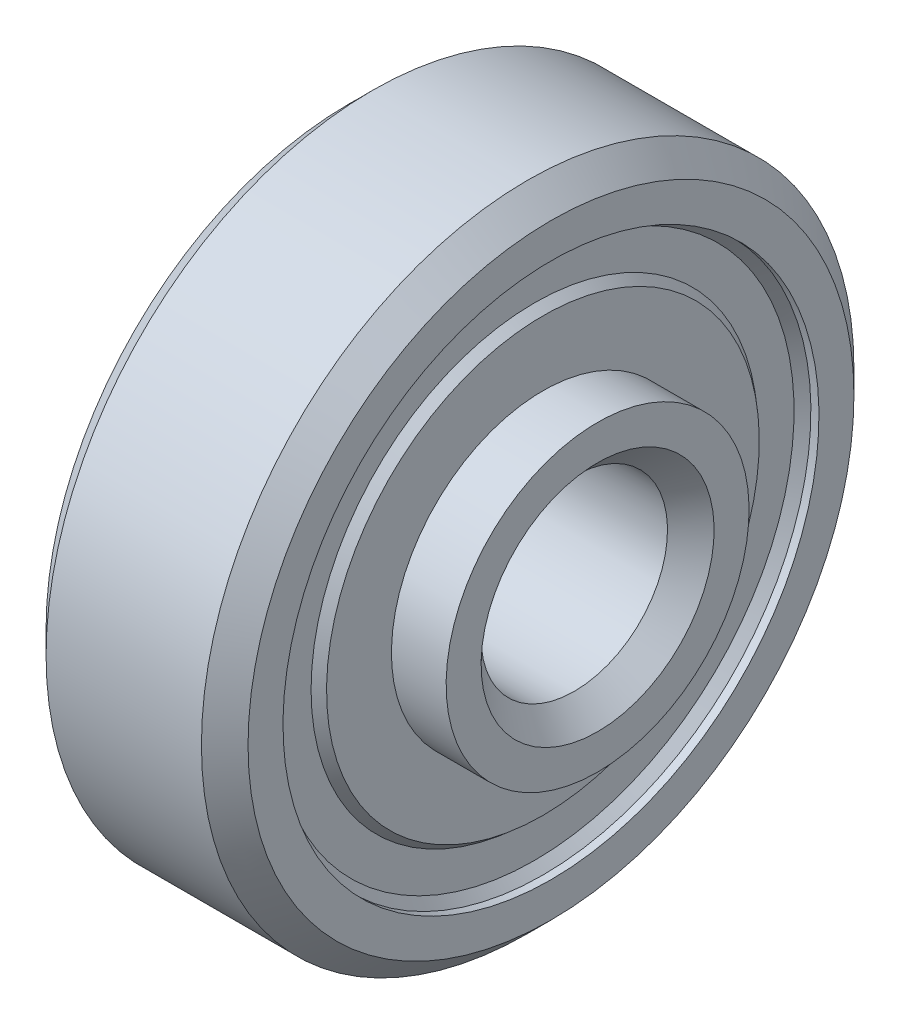
ISO-10303-21;
HEADER;
FILE_DESCRIPTION(('STEP AP214'),'2;1');
FILE_NAME('part.step','',(''),(''),'','','');
FILE_SCHEMA(('AUTOMOTIVE_DESIGN { 1 0 10303 214 1 1 1 1 }'));
ENDSEC;
DATA;
#1=APPLICATION_CONTEXT('core data for automotive mechanical design processes');
#2=APPLICATION_PROTOCOL_DEFINITION('international standard','automotive_design',2000,#1);
#3=PRODUCT_CONTEXT('',#1,'mechanical');
#4=PRODUCT('Part','Part','',(#3));
#5=PRODUCT_RELATED_PRODUCT_CATEGORY('part','',(#4));
#6=PRODUCT_DEFINITION_FORMATION('','',#4);
#7=PRODUCT_DEFINITION_CONTEXT('part definition',#1,'design');
#8=PRODUCT_DEFINITION('design','',#6,#7);
#9=PRODUCT_DEFINITION_SHAPE('','',#8);
#10=(LENGTH_UNIT() NAMED_UNIT(*) SI_UNIT(.MILLI.,.METRE.));
#11=(NAMED_UNIT(*) PLANE_ANGLE_UNIT() SI_UNIT($,.RADIAN.));
#12=(NAMED_UNIT(*) SI_UNIT($,.STERADIAN.) SOLID_ANGLE_UNIT());
#13=UNCERTAINTY_MEASURE_WITH_UNIT(LENGTH_MEASURE(1.E-05),#10,'distance_accuracy_value','');
#14=(GEOMETRIC_REPRESENTATION_CONTEXT(3) GLOBAL_UNCERTAINTY_ASSIGNED_CONTEXT((#13)) GLOBAL_UNIT_ASSIGNED_CONTEXT((#10,
#11,#12)) REPRESENTATION_CONTEXT('',''));
#15=CARTESIAN_POINT('',(0.,0.,0.));
#16=DIRECTION('',(0.,0.,1.));
#17=DIRECTION('',(1.,0.,0.));
#18=AXIS2_PLACEMENT_3D('',#15,#16,#17);
#19=CARTESIAN_POINT('',(11.6666666666667,0.,0.));
#20=DIRECTION('',(-1.,0.,0.));
#21=DIRECTION('',(0.,-1.,0.));
#22=AXIS2_PLACEMENT_3D('',#19,#20,#21);
#23=TOROIDAL_SURFACE('',#22,13.3249973942044,1.875);
#24=CARTESIAN_POINT('',(12.0967939863605,0.,0.));
#25=DIRECTION('',(-1.,0.,0.));
#26=DIRECTION('',(0.,-1.,0.));
#27=AXIS2_PLACEMENT_3D('',#24,#25,#26);
#28=CIRCLE('',#27,11.4999999999999);
#29=CARTESIAN_POINT('',(12.0967939863606,-11.4999999999998,0.));
#30=VERTEX_POINT('',#29);
#31=EDGE_CURVE('E99',#30,#30,#28,.T.);
#32=ORIENTED_EDGE('',*,*,#31,.T.);
#33=EDGE_LOOP('',(#32));
#34=FACE_BOUND('',#33,.T.);
#35=CARTESIAN_POINT('',(11.236539346973,0.,0.));
#36=DIRECTION('',(-1.,0.,0.));
#37=DIRECTION('',(0.,-1.,0.));
#38=AXIS2_PLACEMENT_3D('',#35,#36,#37);
#39=CIRCLE('',#38,11.4999999999999);
#40=CARTESIAN_POINT('',(11.2365393469731,-11.4999999999999,0.));
#41=VERTEX_POINT('',#40);
#42=EDGE_CURVE('E11',#41,#41,#39,.T.);
#43=ORIENTED_EDGE('',*,*,#42,.F.);
#44=EDGE_LOOP('',(#43));
#45=FACE_BOUND('',#44,.T.);
#46=ADVANCED_FACE('F50',(#34,#45),#23,.F.);
#47=CARTESIAN_POINT('',(0.,0.,0.));
#48=DIRECTION('',(-1.,0.,0.));
#49=DIRECTION('',(0.,-1.,0.));
#50=AXIS2_PLACEMENT_3D('',#47,#48,#49);
#51=CYLINDRICAL_SURFACE('',#50,11.4999999999999);
#52=ORIENTED_EDGE('',*,*,#42,.T.);
#53=EDGE_LOOP('',(#52));
#54=FACE_BOUND('',#53,.T.);
#55=CARTESIAN_POINT('',(7.76346065302716,0.,0.));
#56=DIRECTION('',(-1.,0.,0.));
#57=DIRECTION('',(0.,-1.,0.));
#58=AXIS2_PLACEMENT_3D('',#55,#56,#57);
#59=CIRCLE('',#58,11.5);
#60=CARTESIAN_POINT('',(7.76346065302723,-11.4999999999999,0.));
#61=VERTEX_POINT('',#60);
#62=EDGE_CURVE('E56',#61,#61,#59,.T.);
#63=ORIENTED_EDGE('',*,*,#62,.F.);
#64=EDGE_LOOP('',(#63));
#65=FACE_BOUND('',#64,.T.);
#66=ADVANCED_FACE('F117',(#54,#65),#51,.T.);
#67=CARTESIAN_POINT('',(7.33333333333341,0.,0.));
#68=DIRECTION('',(-1.,0.,0.));
#69=DIRECTION('',(0.,-1.,0.));
#70=AXIS2_PLACEMENT_3D('',#67,#68,#69);
#71=TOROIDAL_SURFACE('',#70,13.3249973942044,1.875);
#72=ORIENTED_EDGE('',*,*,#62,.T.);
#73=EDGE_LOOP('',(#72));
#74=FACE_BOUND('',#73,.T.);
#75=CARTESIAN_POINT('',(6.90320601363964,0.,0.));
#76=DIRECTION('',(-1.,0.,0.));
#77=DIRECTION('',(0.,-1.,0.));
#78=AXIS2_PLACEMENT_3D('',#75,#76,#77);
#79=CIRCLE('',#78,11.5);
#80=CARTESIAN_POINT('',(6.90320601363971,-11.4999999999999,0.));
#81=VERTEX_POINT('',#80);
#82=EDGE_CURVE('E60',#81,#81,#79,.T.);
#83=ORIENTED_EDGE('',*,*,#82,.F.);
#84=EDGE_LOOP('',(#83));
#85=FACE_BOUND('',#84,.T.);
#86=ADVANCED_FACE('F121',(#74,#85),#71,.F.);
#87=CARTESIAN_POINT('',(0.,0.,0.));
#88=DIRECTION('',(-1.,0.,0.));
#89=DIRECTION('',(0.,-1.,0.));
#90=AXIS2_PLACEMENT_3D('',#87,#88,#89);
#91=CYLINDRICAL_SURFACE('',#90,11.5);
#92=ORIENTED_EDGE('',*,*,#82,.T.);
#93=EDGE_LOOP('',(#92));
#94=FACE_BOUND('',#93,.T.);
#95=CARTESIAN_POINT('',(5.16666666666674,0.,0.));
#96=DIRECTION('',(-1.,0.,0.));
#97=DIRECTION('',(0.,-1.,0.));
#98=AXIS2_PLACEMENT_3D('',#95,#96,#97);
#99=CIRCLE('',#98,11.5);
#100=CARTESIAN_POINT('',(5.16666666666681,-11.4999999999999,0.));
#101=VERTEX_POINT('',#100);
#102=EDGE_CURVE('E64',#101,#101,#99,.T.);
#103=ORIENTED_EDGE('',*,*,#102,.F.);
#104=EDGE_LOOP('',(#103));
#105=FACE_BOUND('',#104,.T.);
#106=ADVANCED_FACE('F125',(#94,#105),#91,.T.);
#107=CARTESIAN_POINT('',(4.62500000000006,0.,0.));
#108=DIRECTION('',(1.,0.,0.));
#109=DIRECTION('',(0.,1.,0.));
#110=AXIS2_PLACEMENT_3D('',#107,#108,#109);
#111=CONICAL_SURFACE('',#110,9.74999999999997,1.27062515596478);
#112=ORIENTED_EDGE('',*,*,#102,.T.);
#113=EDGE_LOOP('',(#112));
#114=FACE_BOUND('',#113,.T.);
#115=CARTESIAN_POINT('',(4.62500000000006,0.,0.));
#116=DIRECTION('',(-1.,0.,0.));
#117=DIRECTION('',(0.,-1.,0.));
#118=AXIS2_PLACEMENT_3D('',#115,#116,#117);
#119=CIRCLE('',#118,9.74999999999997);
#120=CARTESIAN_POINT('',(4.62500000000012,-9.74999999999995,0.));
#121=VERTEX_POINT('',#120);
#122=EDGE_CURVE('E69',#121,#121,#119,.T.);
#123=ORIENTED_EDGE('',*,*,#122,.F.);
#124=EDGE_LOOP('',(#123));
#125=FACE_BOUND('',#124,.T.);
#126=ADVANCED_FACE('F131',(#114,#125),#111,.T.);
#127=CARTESIAN_POINT('',(0.,0.,0.));
#128=DIRECTION('',(-1.,0.,0.));
#129=DIRECTION('',(0.,-1.,0.));
#130=AXIS2_PLACEMENT_3D('',#127,#128,#129);
#131=CYLINDRICAL_SURFACE('',#130,9.74999999999999);
#132=ORIENTED_EDGE('',*,*,#122,.T.);
#133=EDGE_LOOP('',(#132));
#134=FACE_BOUND('',#133,.T.);
#135=CARTESIAN_POINT('',(0.,0.,0.));
#136=DIRECTION('',(-1.,0.,0.));
#137=DIRECTION('',(0.,-1.,0.));
#138=AXIS2_PLACEMENT_3D('',#135,#136,#137);
#139=CIRCLE('',#138,9.75);
#140=CARTESIAN_POINT('',(1.15715623682421E-13,-9.75,0.));
#141=VERTEX_POINT('',#140);
#142=EDGE_CURVE('E72',#141,#141,#139,.T.);
#143=ORIENTED_EDGE('',*,*,#142,.F.);
#144=EDGE_LOOP('',(#143));
#145=FACE_BOUND('',#144,.T.);
#146=ADVANCED_FACE('F135',(#134,#145),#131,.T.);
#147=CARTESIAN_POINT('',(1.52655665885959E-13,-5.47038840179403,0.));
#148=DIRECTION('',(-1.,0.,0.));
#149=DIRECTION('',(0.,-1.,0.));
#150=AXIS2_PLACEMENT_3D('',#147,#148,#149);
#151=PLANE('',#150);
#152=ORIENTED_EDGE('',*,*,#142,.T.);
#153=EDGE_LOOP('',(#152));
#154=FACE_BOUND('',#153,.T.);
#155=CARTESIAN_POINT('',(0.,0.,0.));
#156=DIRECTION('',(-1.,0.,0.));
#157=DIRECTION('',(0.,-1.,0.));
#158=AXIS2_PLACEMENT_3D('',#155,#156,#157);
#159=CIRCLE('',#158,7.50000000010686);
#160=CARTESIAN_POINT('',(1.01822283886659E-13,-7.50000000010686,0.));
#161=VERTEX_POINT('',#160);
#162=EDGE_CURVE('E76',#161,#161,#159,.T.);
#163=ORIENTED_EDGE('',*,*,#162,.F.);
#164=EDGE_LOOP('',(#163));
#165=FACE_BOUND('',#164,.T.);
#166=ADVANCED_FACE('F139',(#154,#165),#151,.T.);
#167=CARTESIAN_POINT('',(0.,0.,0.));
#168=DIRECTION('',(-1.,0.,0.));
#169=DIRECTION('',(0.,-1.,0.));
#170=AXIS2_PLACEMENT_3D('',#167,#168,#169);
#171=CONICAL_SURFACE('',#170,7.50000000010686,0.785398163397455);
#172=CARTESIAN_POINT('',(1.5000000001103,0.,0.));
#173=DIRECTION('',(-1.,0.,0.));
#174=DIRECTION('',(0.,-1.,0.));
#175=AXIS2_PLACEMENT_3D('',#172,#173,#174);
#176=CIRCLE('',#175,5.99999999999658);
#177=CARTESIAN_POINT('',(1.50000000011034,-5.99999999999658,0.));
#178=VERTEX_POINT('',#177);
#179=EDGE_CURVE('E80',#178,#178,#176,.T.);
#180=ORIENTED_EDGE('',*,*,#179,.F.);
#181=EDGE_LOOP('',(#180));
#182=FACE_BOUND('',#181,.T.);
#183=ORIENTED_EDGE('',*,*,#162,.T.);
#184=EDGE_LOOP('',(#183));
#185=FACE_BOUND('',#184,.T.);
#186=ADVANCED_FACE('F143',(#182,#185),#171,.F.);
#187=CARTESIAN_POINT('',(0.,0.,0.));
#188=DIRECTION('',(-1.,0.,0.));
#189=DIRECTION('',(0.,-1.,0.));
#190=AXIS2_PLACEMENT_3D('',#187,#188,#189);
#191=CYLINDRICAL_SURFACE('',#190,5.99999999999653);
#192=CARTESIAN_POINT('',(17.5000000001104,1.06685493772574E-13,0.));
#193=DIRECTION('',(-1.,0.,0.));
#194=DIRECTION('',(0.,-1.,0.));
#195=AXIS2_PLACEMENT_3D('',#192,#193,#194);
#196=CIRCLE('',#195,5.99999999999648);
#197=CARTESIAN_POINT('',(17.5000000001104,-5.99999999999638,0.));
#198=VERTEX_POINT('',#197);
#199=EDGE_CURVE('E84',#198,#198,#196,.T.);
#200=ORIENTED_EDGE('',*,*,#199,.F.);
#201=EDGE_LOOP('',(#200));
#202=FACE_BOUND('',#201,.T.);
#203=ORIENTED_EDGE('',*,*,#179,.T.);
#204=EDGE_LOOP('',(#203));
#205=FACE_BOUND('',#204,.T.);
#206=ADVANCED_FACE('F147',(#202,#205),#191,.F.);
#207=CARTESIAN_POINT('',(17.5000000001104,1.06685493772574E-13,0.));
#208=DIRECTION('',(1.,0.,0.));
#209=DIRECTION('',(0.,1.,0.));
#210=AXIS2_PLACEMENT_3D('',#207,#208,#209);
#211=CONICAL_SURFACE('',#210,5.99999999999648,0.785398163397442);
#212=CARTESIAN_POINT('',(19.0000000001104,1.17961196366423E-13,0.));
#213=DIRECTION('',(-1.,0.,0.));
#214=DIRECTION('',(0.,-1.,0.));
#215=AXIS2_PLACEMENT_3D('',#212,#213,#214);
#216=CIRCLE('',#215,7.49999999999647);
#217=CARTESIAN_POINT('',(19.0000000001104,-7.49999999999636,0.));
#218=VERTEX_POINT('',#217);
#219=EDGE_CURVE('E87',#218,#218,#216,.T.);
#220=ORIENTED_EDGE('',*,*,#219,.F.);
#221=EDGE_LOOP('',(#220));
#222=FACE_BOUND('',#221,.T.);
#223=ORIENTED_EDGE('',*,*,#199,.T.);
#224=EDGE_LOOP('',(#223));
#225=FACE_BOUND('',#224,.T.);
#226=ADVANCED_FACE('F151',(#222,#225),#211,.F.);
#227=CARTESIAN_POINT('',(19.0000000001104,-5.47038840179402,0.));
#228=DIRECTION('',(-1.,0.,0.));
#229=DIRECTION('',(0.,-1.,0.));
#230=AXIS2_PLACEMENT_3D('',#227,#228,#229);
#231=PLANE('',#230);
#232=CARTESIAN_POINT('',(19.0000000001104,1.17961196366423E-13,0.));
#233=DIRECTION('',(-1.,0.,0.));
#234=DIRECTION('',(0.,-1.,0.));
#235=AXIS2_PLACEMENT_3D('',#232,#233,#234);
#236=CIRCLE('',#235,9.74999999999988);
#237=CARTESIAN_POINT('',(19.0000000001104,-9.74999999999976,0.));
#238=VERTEX_POINT('',#237);
#239=EDGE_CURVE('E90',#238,#238,#236,.T.);
#240=ORIENTED_EDGE('',*,*,#239,.F.);
#241=EDGE_LOOP('',(#240));
#242=FACE_BOUND('',#241,.T.);
#243=ORIENTED_EDGE('',*,*,#219,.T.);
#244=EDGE_LOOP('',(#243));
#245=FACE_BOUND('',#244,.T.);
#246=ADVANCED_FACE('F155',(#242,#245),#231,.F.);
#247=CARTESIAN_POINT('',(0.,0.,0.));
#248=DIRECTION('',(-1.,0.,0.));
#249=DIRECTION('',(0.,-1.,0.));
#250=AXIS2_PLACEMENT_3D('',#247,#248,#249);
#251=CYLINDRICAL_SURFACE('',#250,9.7499999999999);
#252=ORIENTED_EDGE('',*,*,#239,.T.);
#253=EDGE_LOOP('',(#252));
#254=FACE_BOUND('',#253,.T.);
#255=CARTESIAN_POINT('',(14.3750000000001,0.,0.));
#256=DIRECTION('',(-1.,0.,0.));
#257=DIRECTION('',(0.,-1.,0.));
#258=AXIS2_PLACEMENT_3D('',#255,#256,#257);
#259=CIRCLE('',#258,9.74999999999991);
#260=CARTESIAN_POINT('',(14.3750000000001,-9.74999999999982,0.));
#261=VERTEX_POINT('',#260);
#262=EDGE_CURVE('E93',#261,#261,#259,.T.);
#263=ORIENTED_EDGE('',*,*,#262,.F.);
#264=EDGE_LOOP('',(#263));
#265=FACE_BOUND('',#264,.T.);
#266=ADVANCED_FACE('F113',(#254,#265),#251,.T.);
#267=CARTESIAN_POINT('',(13.8333333333334,0.,0.));
#268=DIRECTION('',(-1.,0.,0.));
#269=DIRECTION('',(0.,-1.,0.));
#270=AXIS2_PLACEMENT_3D('',#267,#268,#269);
#271=CONICAL_SURFACE('',#270,11.4999999999999,1.27062515596479);
#272=ORIENTED_EDGE('',*,*,#262,.T.);
#273=EDGE_LOOP('',(#272));
#274=FACE_BOUND('',#273,.T.);
#275=CARTESIAN_POINT('',(13.8333333333334,0.,0.));
#276=DIRECTION('',(-1.,0.,0.));
#277=DIRECTION('',(0.,-1.,0.));
#278=AXIS2_PLACEMENT_3D('',#275,#276,#277);
#279=CIRCLE('',#278,11.4999999999999);
#280=CARTESIAN_POINT('',(13.8333333333335,-11.4999999999998,0.));
#281=VERTEX_POINT('',#280);
#282=EDGE_CURVE('E96',#281,#281,#279,.T.);
#283=ORIENTED_EDGE('',*,*,#282,.F.);
#284=EDGE_LOOP('',(#283));
#285=FACE_BOUND('',#284,.T.);
#286=ADVANCED_FACE('F107',(#274,#285),#271,.T.);
#287=CARTESIAN_POINT('',(0.,0.,0.));
#288=DIRECTION('',(-1.,0.,0.));
#289=DIRECTION('',(0.,-1.,0.));
#290=AXIS2_PLACEMENT_3D('',#287,#288,#289);
#291=CYLINDRICAL_SURFACE('',#290,11.4999999999999);
#292=ORIENTED_EDGE('',*,*,#282,.T.);
#293=EDGE_LOOP('',(#292));
#294=FACE_BOUND('',#293,.T.);
#295=ORIENTED_EDGE('',*,*,#31,.F.);
#296=EDGE_LOOP('',(#295));
#297=FACE_BOUND('',#296,.T.);
#298=ADVANCED_FACE('F105',(#294,#297),#291,.T.);
#299=CLOSED_SHELL('',(#46,#66,#86,#106,#126,#146,#166,#186,#206,#226,#246,#266,#286,#298));
#300=MANIFOLD_SOLID_BREP('B2',#299);
#301=CARTESIAN_POINT('',(9.50000000000001,0.,0.));
#302=DIRECTION('',(-1.,0.,0.));
#303=DIRECTION('',(0.,1.,0.));
#304=AXIS2_PLACEMENT_3D('',#301,#302,#303);
#305=SPHERICAL_SURFACE('',#304,15.375);
#306=CARTESIAN_POINT('',(5.16666666666676,0.,0.));
#307=DIRECTION('',(-1.,0.,0.));
#308=DIRECTION('',(0.,-1.,0.));
#309=AXIS2_PLACEMENT_3D('',#306,#307,#308);
#310=CIRCLE('',#309,14.7517065867723);
#311=CARTESIAN_POINT('',(5.16666666666667,14.7517065867723,0.));
#312=VERTEX_POINT('',#311);
#313=EDGE_CURVE('E337',#312,#312,#310,.T.);
#314=CARTESIAN_POINT('',(13.8333333333334,0.,0.));
#315=DIRECTION('',(-1.,0.,0.));
#316=DIRECTION('',(0.,-1.,0.));
#317=AXIS2_PLACEMENT_3D('',#314,#315,#316);
#318=CIRCLE('',#317,14.7517065867723);
#319=CARTESIAN_POINT('',(13.8333333333333,14.7517065867723,0.));
#320=VERTEX_POINT('',#319);
#321=EDGE_CURVE('E49',#320,#320,#318,.T.);
#322=CARTESIAN_POINT('',(5.16666666666667,14.7517065867723,0.));
#323=CARTESIAN_POINT('',(5.2544744083613,14.7775003246166,0.));
#324=CARTESIAN_POINT('',(5.34251249946757,14.8025098875159,0.));
#325=CARTESIAN_POINT('',(5.51902119911412,14.8509530849714,0.));
#326=CARTESIAN_POINT('',(5.60749180765442,14.8743867195275,0.));
#327=CARTESIAN_POINT('',(5.78483736077979,14.9196704818431,0.));
#328=CARTESIAN_POINT('',(5.87371230536488,14.9415206096025,0.));
#329=CARTESIAN_POINT('',(6.05183818330579,14.9836304194508,0.));
#330=CARTESIAN_POINT('',(6.14108911666162,15.0038901015398,0.));
#331=CARTESIAN_POINT('',(6.31993851488075,15.0428125522382,0.));
#332=CARTESIAN_POINT('',(6.40953697974405,15.0614753208477,0.));
#333=CARTESIAN_POINT('',(6.58905287024463,15.0971979956518,0.));
#334=CARTESIAN_POINT('',(6.6789702958819,15.1142579018465,0.));
#335=CARTESIAN_POINT('',(6.85909543620113,15.1467694113984,0.));
#336=CARTESIAN_POINT('',(6.94930315088309,15.1622210147556,0.));
#337=CARTESIAN_POINT('',(7.12998010480774,15.191510991742,0.));
#338=CARTESIAN_POINT('',(7.22044934405043,15.2053493653711,0.));
#339=CARTESIAN_POINT('',(7.40162049927156,15.2314084702337,0.));
#340=CARTESIAN_POINT('',(7.49232241525,15.2436292014671,0.));
#341=CARTESIAN_POINT('',(7.67393000191058,15.2664491247364,0.));
#342=CARTESIAN_POINT('',(7.76483567259271,15.2770483167723,0.));
#343=CARTESIAN_POINT('',(7.94682178166121,15.29662178189,0.));
#344=CARTESIAN_POINT('',(8.03790222004757,15.3055960549718,0.));
#345=CARTESIAN_POINT('',(8.22020882179611,15.3219168205645,0.));
#346=CARTESIAN_POINT('',(8.31143498515827,15.3292633130755,0.));
#347=CARTESIAN_POINT('',(8.49400394766305,15.3423261749576,0.));
#348=CARTESIAN_POINT('',(8.58534674680566,15.3480425443289,0.));
#349=CARTESIAN_POINT('',(8.76811985448437,15.3578433371586,0.));
#350=CARTESIAN_POINT('',(8.85955016302047,15.3619277606172,0.));
#351=CARTESIAN_POINT('',(9.04246913519519,15.3684633592256,0.));
#352=CARTESIAN_POINT('',(9.1339577988338,15.3709145343754,0.));
#353=CARTESIAN_POINT('',(9.31696430831495,15.3741828547626,0.));
#354=CARTESIAN_POINT('',(9.40848215415747,15.375,0.));
#355=CARTESIAN_POINT('',(9.59151784584252,15.375,0.));
#356=CARTESIAN_POINT('',(9.68303569168505,15.3741828547626,0.));
#357=CARTESIAN_POINT('',(9.8660422011662,15.3709145343754,0.));
#358=CARTESIAN_POINT('',(9.95753086480481,15.3684633592256,0.));
#359=CARTESIAN_POINT('',(10.1404498369795,15.3619277606172,0.));
#360=CARTESIAN_POINT('',(10.2318801455156,15.3578433371586,0.));
#361=CARTESIAN_POINT('',(10.4146532531943,15.3480425443289,0.));
#362=CARTESIAN_POINT('',(10.505996052337,15.3423261749576,0.));
#363=CARTESIAN_POINT('',(10.6885650148417,15.3292633130755,0.));
#364=CARTESIAN_POINT('',(10.7797911782039,15.3219168205645,0.));
#365=CARTESIAN_POINT('',(10.9620977799524,15.3055960549718,0.));
#366=CARTESIAN_POINT('',(11.0531782183388,15.29662178189,0.));
#367=CARTESIAN_POINT('',(11.2351643274073,15.2770483167723,0.));
#368=CARTESIAN_POINT('',(11.3260699980894,15.2664491247364,0.));
#369=CARTESIAN_POINT('',(11.50767758475,15.2436292014671,0.));
#370=CARTESIAN_POINT('',(11.5983795007284,15.2314084702337,0.));
#371=CARTESIAN_POINT('',(11.7795506559496,15.2053493653711,0.));
#372=CARTESIAN_POINT('',(11.8700198951923,15.191510991742,0.));
#373=CARTESIAN_POINT('',(12.0506968491169,15.1622210147556,0.));
#374=CARTESIAN_POINT('',(12.1409045637989,15.1467694113984,0.));
#375=CARTESIAN_POINT('',(12.3210297041181,15.1142579018465,0.));
#376=CARTESIAN_POINT('',(12.4109471297554,15.0971979956518,0.));
#377=CARTESIAN_POINT('',(12.5904630202559,15.0614753208477,0.));
#378=CARTESIAN_POINT('',(12.6800614851193,15.0428125522382,0.));
#379=CARTESIAN_POINT('',(12.8589108833384,15.0038901015398,0.));
#380=CARTESIAN_POINT('',(12.9481618166942,14.9836304194508,0.));
#381=CARTESIAN_POINT('',(13.1262876946351,14.9415206096025,0.));
#382=CARTESIAN_POINT('',(13.2151626392202,14.9196704818431,0.));
#383=CARTESIAN_POINT('',(13.3925081923456,14.8743867195275,0.));
#384=CARTESIAN_POINT('',(13.4809788008859,14.8509530849714,0.));
#385=CARTESIAN_POINT('',(13.6574875005324,14.8025098875159,0.));
#386=CARTESIAN_POINT('',(13.7455255916387,14.7775003246166,0.));
#387=CARTESIAN_POINT('',(13.8333333333333,14.7517065867723,0.));
#388=B_SPLINE_CURVE_WITH_KNOTS('',3,(#322,#323,#324,#325,#326,#327,#328,#329,#330,#331,#332,
#333,#334,#335,#336,#337,#338,#339,#340,#341,#342,#343,#344,#345,#346,#347,#348,#349,#350,#351,
#352,#353,#354,#355,#356,#357,#358,#359,#360,#361,#362,#363,#364,#365,#366,#367,#368,#369,#370,
#371,#372,#373,#374,#375,#376,#377,#378,#379,#380,#381,#382,#383,#384,#385,#386,#387),
.UNSPECIFIED.,.F.,.F.,(4,2,2,2,2,2,2,2,2,2,2,2,2,2,2,2,2,2,2,2,2,2,2,2,2,2,2,2,2,2,2,2,4),(0.,
0.274549889824796,0.54909977964959,0.823649669474385,1.09819955929918,1.37274944912398,
1.64729933894877,1.92184922877357,2.19639911859836,2.47094900842316,2.74549889824795,
3.02004878807275,3.29459867789754,3.56914856772234,3.84369845754713,4.11824834737193,
4.39279823719672,4.66734812702152,4.94189801684631,5.2164479066711,5.4909977964959,
5.76554768632069,6.04009757614549,6.31464746597029,6.58919735579508,6.86374724561987,
7.13829713544467,7.41284702526947,7.68739691509426,7.96194680491905,8.23649669474385,
8.51104658456864,8.78559647439344),.UNSPECIFIED.);
#389=EDGE_CURVE('BSEAM292',#312,#320,#388,.T.);
#390=ORIENTED_EDGE('',*,*,#313,.T.);
#391=ORIENTED_EDGE('',*,*,#321,.F.);
#392=ORIENTED_EDGE('',*,*,#389,.T.);
#393=ORIENTED_EDGE('',*,*,#389,.F.);
#394=EDGE_LOOP('',(#390,#392,#391,#393));
#395=FACE_BOUND('',#394,.T.);
#396=ADVANCED_FACE('F292',(#395),#305,.F.);
#397=CARTESIAN_POINT('',(13.8333333333335,-5.47038840179402,0.));
#398=DIRECTION('',(1.,0.,0.));
#399=DIRECTION('',(0.,1.,0.));
#400=AXIS2_PLACEMENT_3D('',#397,#398,#399);
#401=PLANE('',#400);
#402=ORIENTED_EDGE('',*,*,#321,.T.);
#403=EDGE_LOOP('',(#402));
#404=FACE_BOUND('',#403,.T.);
#405=CARTESIAN_POINT('',(13.8333333333334,0.,0.));
#406=DIRECTION('',(-1.,0.,0.));
#407=DIRECTION('',(0.,-1.,0.));
#408=AXIS2_PLACEMENT_3D('',#405,#406,#407);
#409=CIRCLE('',#408,18.8966666666666);
#410=CARTESIAN_POINT('',(13.8333333333336,-18.8966666666665,0.));
#411=VERTEX_POINT('',#410);
#412=EDGE_CURVE('E298',#411,#411,#409,.T.);
#413=ORIENTED_EDGE('',*,*,#412,.F.);
#414=EDGE_LOOP('',(#413));
#415=FACE_BOUND('',#414,.T.);
#416=ADVANCED_FACE('F374',(#404,#415),#401,.T.);
#417=CARTESIAN_POINT('',(13.8333333333334,0.,0.));
#418=DIRECTION('',(-1.,0.,0.));
#419=DIRECTION('',(0.,-1.,0.));
#420=AXIS2_PLACEMENT_3D('',#417,#418,#419);
#421=CONICAL_SURFACE('',#420,18.8966666666666,0.78539816339745);
#422=CARTESIAN_POINT('',(15.4800000000001,0.,0.));
#423=DIRECTION('',(-1.,0.,0.));
#424=DIRECTION('',(0.,-1.,0.));
#425=AXIS2_PLACEMENT_3D('',#422,#423,#424);
#426=CIRCLE('',#425,17.2499999999999);
#427=CARTESIAN_POINT('',(15.4800000000002,-17.2499999999998,0.));
#428=VERTEX_POINT('',#427);
#429=EDGE_CURVE('E303',#428,#428,#426,.T.);
#430=ORIENTED_EDGE('',*,*,#429,.F.);
#431=EDGE_LOOP('',(#430));
#432=FACE_BOUND('',#431,.T.);
#433=ORIENTED_EDGE('',*,*,#412,.T.);
#434=EDGE_LOOP('',(#433));
#435=FACE_BOUND('',#434,.T.);
#436=ADVANCED_FACE('F378',(#432,#435),#421,.F.);
#437=CARTESIAN_POINT('',(0.,0.,0.));
#438=DIRECTION('',(-1.,0.,0.));
#439=DIRECTION('',(0.,-1.,0.));
#440=AXIS2_PLACEMENT_3D('',#437,#438,#439);
#441=CYLINDRICAL_SURFACE('',#440,17.2499999999999);
#442=CARTESIAN_POINT('',(16.0000000000001,0.,0.));
#443=DIRECTION('',(-1.,0.,0.));
#444=DIRECTION('',(0.,-1.,0.));
#445=AXIS2_PLACEMENT_3D('',#442,#443,#444);
#446=CIRCLE('',#445,17.2499999999999);
#447=CARTESIAN_POINT('',(16.0000000000002,-17.2499999999998,0.));
#448=VERTEX_POINT('',#447);
#449=EDGE_CURVE('E310',#448,#448,#446,.T.);
#450=ORIENTED_EDGE('',*,*,#449,.F.);
#451=EDGE_LOOP('',(#450));
#452=FACE_BOUND('',#451,.T.);
#453=ORIENTED_EDGE('',*,*,#429,.T.);
#454=EDGE_LOOP('',(#453));
#455=FACE_BOUND('',#454,.T.);
#456=ADVANCED_FACE('F382',(#452,#455),#441,.F.);
#457=CARTESIAN_POINT('',(16.0000000000002,-5.47038840179403,0.));
#458=DIRECTION('',(-1.,0.,0.));
#459=DIRECTION('',(0.,-1.,0.));
#460=AXIS2_PLACEMENT_3D('',#457,#458,#459);
#461=PLANE('',#460);
#462=CARTESIAN_POINT('',(16.0000000000001,0.,0.));
#463=DIRECTION('',(-1.,0.,0.));
#464=DIRECTION('',(0.,-1.,0.));
#465=AXIS2_PLACEMENT_3D('',#462,#463,#464);
#466=CIRCLE('',#465,19.4999999999999);
#467=CARTESIAN_POINT('',(16.0000000000002,-19.4999999999998,0.));
#468=VERTEX_POINT('',#467);
#469=EDGE_CURVE('E315',#468,#468,#466,.T.);
#470=ORIENTED_EDGE('',*,*,#469,.F.);
#471=EDGE_LOOP('',(#470));
#472=FACE_BOUND('',#471,.T.);
#473=ORIENTED_EDGE('',*,*,#449,.T.);
#474=EDGE_LOOP('',(#473));
#475=FACE_BOUND('',#474,.T.);
#476=ADVANCED_FACE('F389',(#472,#475),#461,.F.);
#477=CARTESIAN_POINT('',(14.5000000000001,0.,0.));
#478=DIRECTION('',(-1.,0.,0.));
#479=DIRECTION('',(0.,-1.,0.));
#480=AXIS2_PLACEMENT_3D('',#477,#478,#479);
#481=CONICAL_SURFACE('',#480,20.9999999999999,0.785398163397459);
#482=ORIENTED_EDGE('',*,*,#469,.T.);
#483=EDGE_LOOP('',(#482));
#484=FACE_BOUND('',#483,.T.);
#485=CARTESIAN_POINT('',(14.5000000000001,0.,0.));
#486=DIRECTION('',(-1.,0.,0.));
#487=DIRECTION('',(0.,-1.,0.));
#488=AXIS2_PLACEMENT_3D('',#485,#486,#487);
#489=CIRCLE('',#488,20.9999999999999);
#490=CARTESIAN_POINT('',(14.5000000000003,-20.9999999999998,0.));
#491=VERTEX_POINT('',#490);
#492=EDGE_CURVE('E319',#491,#491,#489,.T.);
#493=ORIENTED_EDGE('',*,*,#492,.F.);
#494=EDGE_LOOP('',(#493));
#495=FACE_BOUND('',#494,.T.);
#496=ADVANCED_FACE('F393',(#484,#495),#481,.T.);
#497=CARTESIAN_POINT('',(0.,0.,0.));
#498=DIRECTION('',(-1.,0.,0.));
#499=DIRECTION('',(0.,-1.,0.));
#500=AXIS2_PLACEMENT_3D('',#497,#498,#499);
#501=CYLINDRICAL_SURFACE('',#500,20.9999999999999);
#502=ORIENTED_EDGE('',*,*,#492,.T.);
#503=EDGE_LOOP('',(#502));
#504=FACE_BOUND('',#503,.T.);
#505=CARTESIAN_POINT('',(4.50000000000012,0.,0.));
#506=DIRECTION('',(-1.,0.,0.));
#507=DIRECTION('',(0.,-1.,0.));
#508=AXIS2_PLACEMENT_3D('',#505,#506,#507);
#509=CIRCLE('',#508,21.);
#510=CARTESIAN_POINT('',(4.50000000000025,-21.,0.));
#511=VERTEX_POINT('',#510);
#512=EDGE_CURVE('E322',#511,#511,#509,.T.);
#513=ORIENTED_EDGE('',*,*,#512,.F.);
#514=EDGE_LOOP('',(#513));
#515=FACE_BOUND('',#514,.T.);
#516=ADVANCED_FACE('F370',(#504,#515),#501,.T.);
#517=CARTESIAN_POINT('',(3.00000000000011,0.,0.));
#518=DIRECTION('',(1.,0.,0.));
#519=DIRECTION('',(0.,1.,0.));
#520=AXIS2_PLACEMENT_3D('',#517,#518,#519);
#521=CONICAL_SURFACE('',#520,19.5,0.785398163397442);
#522=ORIENTED_EDGE('',*,*,#512,.T.);
#523=EDGE_LOOP('',(#522));
#524=FACE_BOUND('',#523,.T.);
#525=CARTESIAN_POINT('',(3.00000000000011,0.,0.));
#526=DIRECTION('',(-1.,0.,0.));
#527=DIRECTION('',(0.,-1.,0.));
#528=AXIS2_PLACEMENT_3D('',#525,#526,#527);
#529=CIRCLE('',#528,19.5);
#530=CARTESIAN_POINT('',(3.00000000000023,-19.5,0.));
#531=VERTEX_POINT('',#530);
#532=EDGE_CURVE('E325',#531,#531,#529,.T.);
#533=ORIENTED_EDGE('',*,*,#532,.F.);
#534=EDGE_LOOP('',(#533));
#535=FACE_BOUND('',#534,.T.);
#536=ADVANCED_FACE('F364',(#524,#535),#521,.T.);
#537=CARTESIAN_POINT('',(3.00000000000021,-5.47038840179402,0.));
#538=DIRECTION('',(-1.,0.,0.));
#539=DIRECTION('',(0.,-1.,0.));
#540=AXIS2_PLACEMENT_3D('',#537,#538,#539);
#541=PLANE('',#540);
#542=ORIENTED_EDGE('',*,*,#532,.T.);
#543=EDGE_LOOP('',(#542));
#544=FACE_BOUND('',#543,.T.);
#545=CARTESIAN_POINT('',(3.00000000000011,0.,0.));
#546=DIRECTION('',(-1.,0.,0.));
#547=DIRECTION('',(0.,-1.,0.));
#548=AXIS2_PLACEMENT_3D('',#545,#546,#547);
#549=CIRCLE('',#548,17.25);
#550=CARTESIAN_POINT('',(3.00000000000022,-17.25,0.));
#551=VERTEX_POINT('',#550);
#552=EDGE_CURVE('E328',#551,#551,#549,.T.);
#553=ORIENTED_EDGE('',*,*,#552,.F.);
#554=EDGE_LOOP('',(#553));
#555=FACE_BOUND('',#554,.T.);
#556=ADVANCED_FACE('F359',(#544,#555),#541,.T.);
#557=CARTESIAN_POINT('',(0.,0.,0.));
#558=DIRECTION('',(-1.,0.,0.));
#559=DIRECTION('',(0.,-1.,0.));
#560=AXIS2_PLACEMENT_3D('',#557,#558,#559);
#561=CYLINDRICAL_SURFACE('',#560,17.25);
#562=CARTESIAN_POINT('',(3.52000000000011,0.,0.));
#563=DIRECTION('',(-1.,0.,0.));
#564=DIRECTION('',(0.,-1.,0.));
#565=AXIS2_PLACEMENT_3D('',#562,#563,#564);
#566=CIRCLE('',#565,17.25);
#567=CARTESIAN_POINT('',(3.52000000000021,-17.25,0.));
#568=VERTEX_POINT('',#567);
#569=EDGE_CURVE('E331',#568,#568,#566,.T.);
#570=ORIENTED_EDGE('',*,*,#569,.F.);
#571=EDGE_LOOP('',(#570));
#572=FACE_BOUND('',#571,.T.);
#573=ORIENTED_EDGE('',*,*,#552,.T.);
#574=EDGE_LOOP('',(#573));
#575=FACE_BOUND('',#574,.T.);
#576=ADVANCED_FACE('F353',(#572,#575),#561,.F.);
#577=CARTESIAN_POINT('',(3.52000000000011,0.,0.));
#578=DIRECTION('',(1.,0.,0.));
#579=DIRECTION('',(0.,1.,0.));
#580=AXIS2_PLACEMENT_3D('',#577,#578,#579);
#581=CONICAL_SURFACE('',#580,17.25,0.785398163397437);
#582=CARTESIAN_POINT('',(5.16666666666679,0.,0.));
#583=DIRECTION('',(-1.,0.,0.));
#584=DIRECTION('',(0.,-1.,0.));
#585=AXIS2_PLACEMENT_3D('',#582,#583,#584);
#586=CIRCLE('',#585,18.8966666666666);
#587=CARTESIAN_POINT('',(5.16666666666691,-18.8966666666666,0.));
#588=VERTEX_POINT('',#587);
#589=EDGE_CURVE('E334',#588,#588,#586,.T.);
#590=ORIENTED_EDGE('',*,*,#589,.F.);
#591=EDGE_LOOP('',(#590));
#592=FACE_BOUND('',#591,.T.);
#593=ORIENTED_EDGE('',*,*,#569,.T.);
#594=EDGE_LOOP('',(#593));
#595=FACE_BOUND('',#594,.T.);
#596=ADVANCED_FACE('F347',(#592,#595),#581,.F.);
#597=CARTESIAN_POINT('',(5.16666666666687,-5.47038840179405,0.));
#598=DIRECTION('',(1.,0.,0.));
#599=DIRECTION('',(0.,1.,0.));
#600=AXIS2_PLACEMENT_3D('',#597,#598,#599);
#601=PLANE('',#600);
#602=ORIENTED_EDGE('',*,*,#313,.F.);
#603=EDGE_LOOP('',(#602));
#604=FACE_BOUND('',#603,.T.);
#605=ORIENTED_EDGE('',*,*,#589,.T.);
#606=EDGE_LOOP('',(#605));
#607=FACE_BOUND('',#606,.T.);
#608=ADVANCED_FACE('F344',(#604,#607),#601,.F.);
#609=CLOSED_SHELL('',(#396,#416,#436,#456,#476,#496,#516,#536,#556,#576,#596,#608));
#610=MANIFOLD_SOLID_BREP('B6',#609);
#611=CARTESIAN_POINT('',(13.8333333333335,-5.47038840179402,0.));
#612=DIRECTION('',(-1.,0.,0.));
#613=DIRECTION('',(0.,-1.,0.));
#614=AXIS2_PLACEMENT_3D('',#611,#612,#613);
#615=PLANE('',#614);
#616=CARTESIAN_POINT('',(13.8333333333334,0.,0.));
#617=DIRECTION('',(-1.,0.,0.));
#618=DIRECTION('',(0.,-1.,0.));
#619=AXIS2_PLACEMENT_3D('',#616,#617,#618);
#620=CIRCLE('',#619,17.1660393197555);
#621=CARTESIAN_POINT('',(13.8333333333336,-17.1660393197554,0.));
#622=VERTEX_POINT('',#621);
#623=EDGE_CURVE('E545',#622,#622,#620,.T.);
#624=ORIENTED_EDGE('',*,*,#623,.T.);
#625=EDGE_LOOP('',(#624));
#626=FACE_BOUND('',#625,.T.);
#627=CARTESIAN_POINT('',(13.8333333333334,0.,0.));
#628=DIRECTION('',(-1.,0.,0.));
#629=DIRECTION('',(0.,-1.,0.));
#630=AXIS2_PLACEMENT_3D('',#627,#628,#629);
#631=CIRCLE('',#630,13.8657993844721);
#632=CARTESIAN_POINT('',(13.8333333333335,-13.865799384472,0.));
#633=VERTEX_POINT('',#632);
#634=EDGE_CURVE('E291',#633,#633,#631,.T.);
#635=ORIENTED_EDGE('',*,*,#634,.F.);
#636=EDGE_LOOP('',(#635));
#637=FACE_BOUND('',#636,.T.);
#638=ADVANCED_FACE('F511',(#626,#637),#615,.T.);
#639=CARTESIAN_POINT('',(13.8333333333334,0.,0.));
#640=DIRECTION('',(-1.,0.,0.));
#641=DIRECTION('',(0.,-1.,0.));
#642=AXIS2_PLACEMENT_3D('',#639,#640,#641);
#643=CONICAL_SURFACE('',#642,13.8657993844721,0.698131700797729);
#644=CARTESIAN_POINT('',(14.3750000000001,0.,0.));
#645=DIRECTION('',(-1.,0.,0.));
#646=DIRECTION('',(0.,-1.,0.));
#647=AXIS2_PLACEMENT_3D('',#644,#645,#646);
#648=CIRCLE('',#647,13.411287084251);
#649=CARTESIAN_POINT('',(14.3750000000002,-13.4112870842509,0.));
#650=VERTEX_POINT('',#649);
#651=EDGE_CURVE('E517',#650,#650,#648,.T.);
#652=ORIENTED_EDGE('',*,*,#651,.F.);
#653=EDGE_LOOP('',(#652));
#654=FACE_BOUND('',#653,.T.);
#655=ORIENTED_EDGE('',*,*,#634,.T.);
#656=EDGE_LOOP('',(#655));
#657=FACE_BOUND('',#656,.T.);
#658=ADVANCED_FACE('F563',(#654,#657),#643,.F.);
#659=CARTESIAN_POINT('',(14.3750000000002,-5.47038840179403,0.));
#660=DIRECTION('',(-1.,0.,0.));
#661=DIRECTION('',(0.,-1.,0.));
#662=AXIS2_PLACEMENT_3D('',#659,#660,#661);
#663=PLANE('',#662);
#664=ORIENTED_EDGE('',*,*,#651,.T.);
#665=EDGE_LOOP('',(#664));
#666=FACE_BOUND('',#665,.T.);
#667=CARTESIAN_POINT('',(14.3750000000001,0.,0.));
#668=DIRECTION('',(-1.,0.,0.));
#669=DIRECTION('',(0.,-1.,0.));
#670=AXIS2_PLACEMENT_3D('',#667,#668,#669);
#671=CIRCLE('',#670,9.74999999999991);
#672=CARTESIAN_POINT('',(14.3750000000001,-9.74999999999982,0.));
#673=VERTEX_POINT('',#672);
#674=EDGE_CURVE('E521',#673,#673,#671,.T.);
#675=ORIENTED_EDGE('',*,*,#674,.F.);
#676=EDGE_LOOP('',(#675));
#677=FACE_BOUND('',#676,.T.);
#678=ADVANCED_FACE('F567',(#666,#677),#663,.T.);
#679=CARTESIAN_POINT('',(0.,0.,0.));
#680=DIRECTION('',(-1.,0.,0.));
#681=DIRECTION('',(0.,-1.,0.));
#682=AXIS2_PLACEMENT_3D('',#679,#680,#681);
#683=CYLINDRICAL_SURFACE('',#682,9.74999999999991);
#684=CARTESIAN_POINT('',(15.4800000000001,0.,0.));
#685=DIRECTION('',(-1.,0.,0.));
#686=DIRECTION('',(0.,-1.,0.));
#687=AXIS2_PLACEMENT_3D('',#684,#685,#686);
#688=CIRCLE('',#687,9.7499999999999);
#689=CARTESIAN_POINT('',(15.4800000000001,-9.74999999999981,0.));
#690=VERTEX_POINT('',#689);
#691=EDGE_CURVE('E525',#690,#690,#688,.T.);
#692=ORIENTED_EDGE('',*,*,#691,.F.);
#693=EDGE_LOOP('',(#692));
#694=FACE_BOUND('',#693,.T.);
#695=ORIENTED_EDGE('',*,*,#674,.T.);
#696=EDGE_LOOP('',(#695));
#697=FACE_BOUND('',#696,.T.);
#698=ADVANCED_FACE('F572',(#694,#697),#683,.F.);
#699=CARTESIAN_POINT('',(15.4800000000002,-5.47038840179402,0.));
#700=DIRECTION('',(-1.,0.,0.));
#701=DIRECTION('',(0.,-1.,0.));
#702=AXIS2_PLACEMENT_3D('',#699,#700,#701);
#703=PLANE('',#702);
#704=CARTESIAN_POINT('',(15.4800000000001,0.,0.));
#705=DIRECTION('',(-1.,0.,0.));
#706=DIRECTION('',(0.,-1.,0.));
#707=AXIS2_PLACEMENT_3D('',#704,#705,#706);
#708=CIRCLE('',#707,13.9265570465123);
#709=CARTESIAN_POINT('',(15.4800000000002,-13.9265570465122,0.));
#710=VERTEX_POINT('',#709);
#711=EDGE_CURVE('E530',#710,#710,#708,.T.);
#712=ORIENTED_EDGE('',*,*,#711,.F.);
#713=EDGE_LOOP('',(#712));
#714=FACE_BOUND('',#713,.T.);
#715=ORIENTED_EDGE('',*,*,#691,.T.);
#716=EDGE_LOOP('',(#715));
#717=FACE_BOUND('',#716,.T.);
#718=ADVANCED_FACE('F577',(#714,#717),#703,.F.);
#719=CARTESIAN_POINT('',(14.9383333333334,0.,0.));
#720=DIRECTION('',(-1.,0.,0.));
#721=DIRECTION('',(0.,-1.,0.));
#722=AXIS2_PLACEMENT_3D('',#719,#720,#721);
#723=CONICAL_SURFACE('',#722,14.3810693467333,0.698131700797738);
#724=ORIENTED_EDGE('',*,*,#711,.T.);
#725=EDGE_LOOP('',(#724));
#726=FACE_BOUND('',#725,.T.);
#727=CARTESIAN_POINT('',(14.9383333333334,0.,0.));
#728=DIRECTION('',(-1.,0.,0.));
#729=DIRECTION('',(0.,-1.,0.));
#730=AXIS2_PLACEMENT_3D('',#727,#728,#729);
#731=CIRCLE('',#730,14.3810693467333);
#732=CARTESIAN_POINT('',(14.9383333333335,-14.3810693467332,0.));
#733=VERTEX_POINT('',#732);
#734=EDGE_CURVE('E533',#733,#733,#731,.T.);
#735=ORIENTED_EDGE('',*,*,#734,.F.);
#736=EDGE_LOOP('',(#735));
#737=FACE_BOUND('',#736,.T.);
#738=ADVANCED_FACE('F581',(#726,#737),#723,.T.);
#739=CARTESIAN_POINT('',(14.9383333333335,-5.47038840179403,0.));
#740=DIRECTION('',(-1.,0.,0.));
#741=DIRECTION('',(0.,-1.,0.));
#742=AXIS2_PLACEMENT_3D('',#739,#740,#741);
#743=PLANE('',#742);
#744=CARTESIAN_POINT('',(14.9383333333334,0.,0.));
#745=DIRECTION('',(-1.,0.,0.));
#746=DIRECTION('',(0.,-1.,0.));
#747=AXIS2_PLACEMENT_3D('',#744,#745,#746);
#748=CIRCLE('',#747,16.7083333333332);
#749=CARTESIAN_POINT('',(14.9383333333335,-16.7083333333331,0.));
#750=VERTEX_POINT('',#749);
#751=EDGE_CURVE('E536',#750,#750,#748,.T.);
#752=ORIENTED_EDGE('',*,*,#751,.F.);
#753=EDGE_LOOP('',(#752));
#754=FACE_BOUND('',#753,.T.);
#755=ORIENTED_EDGE('',*,*,#734,.T.);
#756=EDGE_LOOP('',(#755));
#757=FACE_BOUND('',#756,.T.);
#758=ADVANCED_FACE('F585',(#754,#757),#743,.F.);
#759=CARTESIAN_POINT('',(14.9383333333334,0.,0.));
#760=DIRECTION('',(1.,0.,0.));
#761=DIRECTION('',(0.,1.,0.));
#762=AXIS2_PLACEMENT_3D('',#759,#760,#761);
#763=CONICAL_SURFACE('',#762,16.7083333333332,0.785398163397447);
#764=CARTESIAN_POINT('',(15.4800000000001,0.,0.));
#765=DIRECTION('',(-1.,0.,0.));
#766=DIRECTION('',(0.,-1.,0.));
#767=AXIS2_PLACEMENT_3D('',#764,#765,#766);
#768=CIRCLE('',#767,17.2499999999999);
#769=CARTESIAN_POINT('',(15.4800000000002,-17.2499999999998,0.));
#770=VERTEX_POINT('',#769);
#771=EDGE_CURVE('E539',#770,#770,#768,.T.);
#772=ORIENTED_EDGE('',*,*,#771,.F.);
#773=EDGE_LOOP('',(#772));
#774=FACE_BOUND('',#773,.T.);
#775=ORIENTED_EDGE('',*,*,#751,.T.);
#776=EDGE_LOOP('',(#775));
#777=FACE_BOUND('',#776,.T.);
#778=ADVANCED_FACE('F559',(#774,#777),#763,.F.);
#779=CARTESIAN_POINT('',(14.698647006789,0.,0.));
#780=DIRECTION('',(-1.,0.,0.));
#781=DIRECTION('',(0.,-1.,0.));
#782=AXIS2_PLACEMENT_3D('',#779,#780,#781);
#783=CONICAL_SURFACE('',#782,18.031352993211,0.785398163397449);
#784=ORIENTED_EDGE('',*,*,#771,.T.);
#785=EDGE_LOOP('',(#784));
#786=FACE_BOUND('',#785,.T.);
#787=CARTESIAN_POINT('',(14.698647006789,0.,0.));
#788=DIRECTION('',(-1.,0.,0.));
#789=DIRECTION('',(0.,-1.,0.));
#790=AXIS2_PLACEMENT_3D('',#787,#788,#789);
#791=CIRCLE('',#790,18.031352993211);
#792=CARTESIAN_POINT('',(14.6986470067891,-18.0313529932109,0.));
#793=VERTEX_POINT('',#792);
#794=EDGE_CURVE('E542',#793,#793,#791,.T.);
#795=ORIENTED_EDGE('',*,*,#794,.F.);
#796=EDGE_LOOP('',(#795));
#797=FACE_BOUND('',#796,.T.);
#798=ADVANCED_FACE('F553',(#786,#797),#783,.T.);
#799=CARTESIAN_POINT('',(13.8333333333334,0.,0.));
#800=DIRECTION('',(1.,0.,0.));
#801=DIRECTION('',(0.,1.,0.));
#802=AXIS2_PLACEMENT_3D('',#799,#800,#801);
#803=CONICAL_SURFACE('',#802,17.1660393197555,0.785398163397444);
#804=ORIENTED_EDGE('',*,*,#794,.T.);
#805=EDGE_LOOP('',(#804));
#806=FACE_BOUND('',#805,.T.);
#807=ORIENTED_EDGE('',*,*,#623,.F.);
#808=EDGE_LOOP('',(#807));
#809=FACE_BOUND('',#808,.T.);
#810=ADVANCED_FACE('F551',(#806,#809),#803,.T.);
#811=CLOSED_SHELL('',(#638,#658,#678,#698,#718,#738,#758,#778,#798,#810));
#812=MANIFOLD_SOLID_BREP('B44',#811);
#813=CARTESIAN_POINT('',(4.62500000000007,0.,0.));
#814=DIRECTION('',(1.,0.,0.));
#815=DIRECTION('',(0.,1.,0.));
#816=AXIS2_PLACEMENT_3D('',#813,#814,#815);
#817=CONICAL_SURFACE('',#816,13.4112870842511,0.698131700797728);
#818=CARTESIAN_POINT('',(5.16666666666676,0.,0.));
#819=DIRECTION('',(-1.,0.,0.));
#820=DIRECTION('',(0.,-1.,0.));
#821=AXIS2_PLACEMENT_3D('',#818,#819,#820);
#822=CIRCLE('',#821,13.8657993844721);
#823=CARTESIAN_POINT('',(5.16666666666685,-13.8657993844721,0.));
#824=VERTEX_POINT('',#823);
#825=EDGE_CURVE('E510',#824,#824,#822,.T.);
#826=ORIENTED_EDGE('',*,*,#825,.F.);
#827=EDGE_LOOP('',(#826));
#828=FACE_BOUND('',#827,.T.);
#829=CARTESIAN_POINT('',(4.62500000000007,0.,0.));
#830=DIRECTION('',(-1.,0.,0.));
#831=DIRECTION('',(0.,-1.,0.));
#832=AXIS2_PLACEMENT_3D('',#829,#830,#831);
#833=CIRCLE('',#832,13.4112870842511);
#834=CARTESIAN_POINT('',(4.62500000000016,-13.4112870842511,0.));
#835=VERTEX_POINT('',#834);
#836=EDGE_CURVE('E715',#835,#835,#833,.T.);
#837=ORIENTED_EDGE('',*,*,#836,.T.);
#838=EDGE_LOOP('',(#837));
#839=FACE_BOUND('',#838,.T.);
#840=ADVANCED_FACE('F678',(#828,#839),#817,.F.);
#841=CARTESIAN_POINT('',(5.16666666666686,-5.47038840179405,0.));
#842=DIRECTION('',(-1.,0.,0.));
#843=DIRECTION('',(0.,-1.,0.));
#844=AXIS2_PLACEMENT_3D('',#841,#842,#843);
#845=PLANE('',#844);
#846=CARTESIAN_POINT('',(5.16666666666676,0.,0.));
#847=DIRECTION('',(-1.,0.,0.));
#848=DIRECTION('',(0.,-1.,0.));
#849=AXIS2_PLACEMENT_3D('',#846,#847,#848);
#850=CIRCLE('',#849,17.1660393197556);
#851=CARTESIAN_POINT('',(5.16666666666687,-17.1660393197555,0.));
#852=VERTEX_POINT('',#851);
#853=EDGE_CURVE('E685',#852,#852,#850,.T.);
#854=ORIENTED_EDGE('',*,*,#853,.F.);
#855=EDGE_LOOP('',(#854));
#856=FACE_BOUND('',#855,.T.);
#857=ORIENTED_EDGE('',*,*,#825,.T.);
#858=EDGE_LOOP('',(#857));
#859=FACE_BOUND('',#858,.T.);
#860=ADVANCED_FACE('F745',(#856,#859),#845,.F.);
#861=CARTESIAN_POINT('',(4.30135299321124,0.,0.));
#862=DIRECTION('',(-1.,0.,0.));
#863=DIRECTION('',(0.,-1.,0.));
#864=AXIS2_PLACEMENT_3D('',#861,#862,#863);
#865=CONICAL_SURFACE('',#864,18.0313529932111,0.78539816339746);
#866=ORIENTED_EDGE('',*,*,#853,.T.);
#867=EDGE_LOOP('',(#866));
#868=FACE_BOUND('',#867,.T.);
#869=CARTESIAN_POINT('',(4.30135299321124,0.,0.));
#870=DIRECTION('',(-1.,0.,0.));
#871=DIRECTION('',(0.,-1.,0.));
#872=AXIS2_PLACEMENT_3D('',#869,#870,#871);
#873=CIRCLE('',#872,18.0313529932111);
#874=CARTESIAN_POINT('',(4.30135299321135,-18.0313529932111,0.));
#875=VERTEX_POINT('',#874);
#876=EDGE_CURVE('E691',#875,#875,#873,.T.);
#877=ORIENTED_EDGE('',*,*,#876,.F.);
#878=EDGE_LOOP('',(#877));
#879=FACE_BOUND('',#878,.T.);
#880=ADVANCED_FACE('F750',(#868,#879),#865,.T.);
#881=CARTESIAN_POINT('',(3.52000000000011,0.,0.));
#882=DIRECTION('',(1.,0.,0.));
#883=DIRECTION('',(0.,1.,0.));
#884=AXIS2_PLACEMENT_3D('',#881,#882,#883);
#885=CONICAL_SURFACE('',#884,17.25,0.785398163397436);
#886=ORIENTED_EDGE('',*,*,#876,.T.);
#887=EDGE_LOOP('',(#886));
#888=FACE_BOUND('',#887,.T.);
#889=CARTESIAN_POINT('',(3.52000000000011,0.,0.));
#890=DIRECTION('',(-1.,0.,0.));
#891=DIRECTION('',(0.,-1.,0.));
#892=AXIS2_PLACEMENT_3D('',#889,#890,#891);
#893=CIRCLE('',#892,17.25);
#894=CARTESIAN_POINT('',(3.52000000000021,-17.25,0.));
#895=VERTEX_POINT('',#894);
#896=EDGE_CURVE('E695',#895,#895,#893,.T.);
#897=ORIENTED_EDGE('',*,*,#896,.F.);
#898=EDGE_LOOP('',(#897));
#899=FACE_BOUND('',#898,.T.);
#900=ADVANCED_FACE('F755',(#888,#899),#885,.T.);
#901=CARTESIAN_POINT('',(3.52000000000011,0.,0.));
#902=DIRECTION('',(-1.,0.,0.));
#903=DIRECTION('',(0.,-1.,0.));
#904=AXIS2_PLACEMENT_3D('',#901,#902,#903);
#905=CONICAL_SURFACE('',#904,17.25,0.785398163397462);
#906=CARTESIAN_POINT('',(4.06166666666677,0.,0.));
#907=DIRECTION('',(-1.,0.,0.));
#908=DIRECTION('',(0.,-1.,0.));
#909=AXIS2_PLACEMENT_3D('',#906,#907,#908);
#910=CIRCLE('',#909,16.7083333333333);
#911=CARTESIAN_POINT('',(4.06166666666687,-16.7083333333333,0.));
#912=VERTEX_POINT('',#911);
#913=EDGE_CURVE('E700',#912,#912,#910,.T.);
#914=ORIENTED_EDGE('',*,*,#913,.F.);
#915=EDGE_LOOP('',(#914));
#916=FACE_BOUND('',#915,.T.);
#917=ORIENTED_EDGE('',*,*,#896,.T.);
#918=EDGE_LOOP('',(#917));
#919=FACE_BOUND('',#918,.T.);
#920=ADVANCED_FACE('F760',(#916,#919),#905,.F.);
#921=CARTESIAN_POINT('',(4.06166666666687,-5.47038840179402,0.));
#922=DIRECTION('',(-1.,0.,0.));
#923=DIRECTION('',(0.,-1.,0.));
#924=AXIS2_PLACEMENT_3D('',#921,#922,#923);
#925=PLANE('',#924);
#926=ORIENTED_EDGE('',*,*,#913,.T.);
#927=EDGE_LOOP('',(#926));
#928=FACE_BOUND('',#927,.T.);
#929=CARTESIAN_POINT('',(4.06166666666676,0.,0.));
#930=DIRECTION('',(-1.,0.,0.));
#931=DIRECTION('',(0.,-1.,0.));
#932=AXIS2_PLACEMENT_3D('',#929,#930,#931);
#933=CIRCLE('',#932,14.3810693467334);
#934=CARTESIAN_POINT('',(4.06166666666684,-14.3810693467334,0.));
#935=VERTEX_POINT('',#934);
#936=EDGE_CURVE('E703',#935,#935,#933,.T.);
#937=ORIENTED_EDGE('',*,*,#936,.F.);
#938=EDGE_LOOP('',(#937));
#939=FACE_BOUND('',#938,.T.);
#940=ADVANCED_FACE('F741',(#928,#939),#925,.T.);
#941=CARTESIAN_POINT('',(3.52000000000008,0.,0.));
#942=DIRECTION('',(1.,0.,0.));
#943=DIRECTION('',(0.,1.,0.));
#944=AXIS2_PLACEMENT_3D('',#941,#942,#943);
#945=CONICAL_SURFACE('',#944,13.9265570465124,0.698131700797728);
#946=ORIENTED_EDGE('',*,*,#936,.T.);
#947=EDGE_LOOP('',(#946));
#948=FACE_BOUND('',#947,.T.);
#949=CARTESIAN_POINT('',(3.52000000000008,0.,0.));
#950=DIRECTION('',(-1.,0.,0.));
#951=DIRECTION('',(0.,-1.,0.));
#952=AXIS2_PLACEMENT_3D('',#949,#950,#951);
#953=CIRCLE('',#952,13.9265570465124);
#954=CARTESIAN_POINT('',(3.52000000000016,-13.9265570465124,0.));
#955=VERTEX_POINT('',#954);
#956=EDGE_CURVE('E706',#955,#955,#953,.T.);
#957=ORIENTED_EDGE('',*,*,#956,.F.);
#958=EDGE_LOOP('',(#957));
#959=FACE_BOUND('',#958,.T.);
#960=ADVANCED_FACE('F735',(#948,#959),#945,.T.);
#961=CARTESIAN_POINT('',(3.52000000000018,-5.47038840179403,0.));
#962=DIRECTION('',(-1.,0.,0.));
#963=DIRECTION('',(0.,-1.,0.));
#964=AXIS2_PLACEMENT_3D('',#961,#962,#963);
#965=PLANE('',#964);
#966=ORIENTED_EDGE('',*,*,#956,.T.);
#967=EDGE_LOOP('',(#966));
#968=FACE_BOUND('',#967,.T.);
#969=CARTESIAN_POINT('',(3.52000000000006,0.,0.));
#970=DIRECTION('',(-1.,0.,0.));
#971=DIRECTION('',(0.,-1.,0.));
#972=AXIS2_PLACEMENT_3D('',#969,#970,#971);
#973=CIRCLE('',#972,9.74999999999998);
#974=CARTESIAN_POINT('',(3.52000000000012,-9.74999999999996,0.));
#975=VERTEX_POINT('',#974);
#976=EDGE_CURVE('E709',#975,#975,#973,.T.);
#977=ORIENTED_EDGE('',*,*,#976,.F.);
#978=EDGE_LOOP('',(#977));
#979=FACE_BOUND('',#978,.T.);
#980=ADVANCED_FACE('F730',(#968,#979),#965,.T.);
#981=CARTESIAN_POINT('',(0.,0.,0.));
#982=DIRECTION('',(-1.,0.,0.));
#983=DIRECTION('',(0.,-1.,0.));
#984=AXIS2_PLACEMENT_3D('',#981,#982,#983);
#985=CYLINDRICAL_SURFACE('',#984,9.74999999999998);
#986=CARTESIAN_POINT('',(4.62500000000006,0.,0.));
#987=DIRECTION('',(-1.,0.,0.));
#988=DIRECTION('',(0.,-1.,0.));
#989=AXIS2_PLACEMENT_3D('',#986,#987,#988);
#990=CIRCLE('',#989,9.74999999999997);
#991=CARTESIAN_POINT('',(4.62500000000012,-9.74999999999995,0.));
#992=VERTEX_POINT('',#991);
#993=EDGE_CURVE('E712',#992,#992,#990,.T.);
#994=ORIENTED_EDGE('',*,*,#993,.F.);
#995=EDGE_LOOP('',(#994));
#996=FACE_BOUND('',#995,.T.);
#997=ORIENTED_EDGE('',*,*,#976,.T.);
#998=EDGE_LOOP('',(#997));
#999=FACE_BOUND('',#998,.T.);
#1000=ADVANCED_FACE('F724',(#996,#999),#985,.F.);
#1001=CARTESIAN_POINT('',(4.62500000000017,-5.47038840179403,0.));
#1002=DIRECTION('',(-1.,0.,0.));
#1003=DIRECTION('',(0.,-1.,0.));
#1004=AXIS2_PLACEMENT_3D('',#1001,#1002,#1003);
#1005=PLANE('',#1004);
#1006=ORIENTED_EDGE('',*,*,#836,.F.);
#1007=EDGE_LOOP('',(#1006));
#1008=FACE_BOUND('',#1007,.T.);
#1009=ORIENTED_EDGE('',*,*,#993,.T.);
#1010=EDGE_LOOP('',(#1009));
#1011=FACE_BOUND('',#1010,.T.);
#1012=ADVANCED_FACE('F721',(#1008,#1011),#1005,.F.);
#1013=CLOSED_SHELL('',(#840,#860,#880,#900,#920,#940,#960,#980,#1000,#1012));
#1014=MANIFOLD_SOLID_BREP('B286',#1013);
#1015=CARTESIAN_POINT('',(11.6666666666667,0.,0.));
#1016=DIRECTION('',(-1.,0.,0.));
#1017=DIRECTION('',(0.,-1.,0.));
#1018=AXIS2_PLACEMENT_3D('',#1015,#1016,#1017);
#1019=TOROIDAL_SURFACE('',#1018,13.3249973942044,1.875);
#1020=CARTESIAN_POINT('',(11.6666666666668,-15.1999973942043,0.));
#1021=VERTEX_POINT('',#1020);
#1022=VERTEX_LOOP('',#1021);
#1023=FACE_BOUND('',#1022,.T.);
#1024=ADVANCED_FACE('F848',(#1023),#1019,.T.);
#1025=CLOSED_SHELL('',(#1024));
#1026=MANIFOLD_SOLID_BREP('B505',#1025);
#1027=CARTESIAN_POINT('',(7.33333333333341,0.,0.));
#1028=DIRECTION('',(-1.,0.,0.));
#1029=DIRECTION('',(0.,-1.,0.));
#1030=AXIS2_PLACEMENT_3D('',#1027,#1028,#1029);
#1031=TOROIDAL_SURFACE('',#1030,13.3249973942044,1.875);
#1032=CARTESIAN_POINT('',(7.33333333333351,-15.1999973942044,0.));
#1033=VERTEX_POINT('',#1032);
#1034=VERTEX_LOOP('',#1033);
#1035=FACE_BOUND('',#1034,.T.);
#1036=ADVANCED_FACE('F864',(#1035),#1031,.T.);
#1037=CLOSED_SHELL('',(#1036));
#1038=MANIFOLD_SOLID_BREP('B674',#1037);
#1039=ADVANCED_BREP_SHAPE_REPRESENTATION('',(#18,#300,#610,#812,#1014,#1026,#1038),#14);
#1040=SHAPE_DEFINITION_REPRESENTATION(#9,#1039);
ENDSEC;
END-ISO-10303-21;
